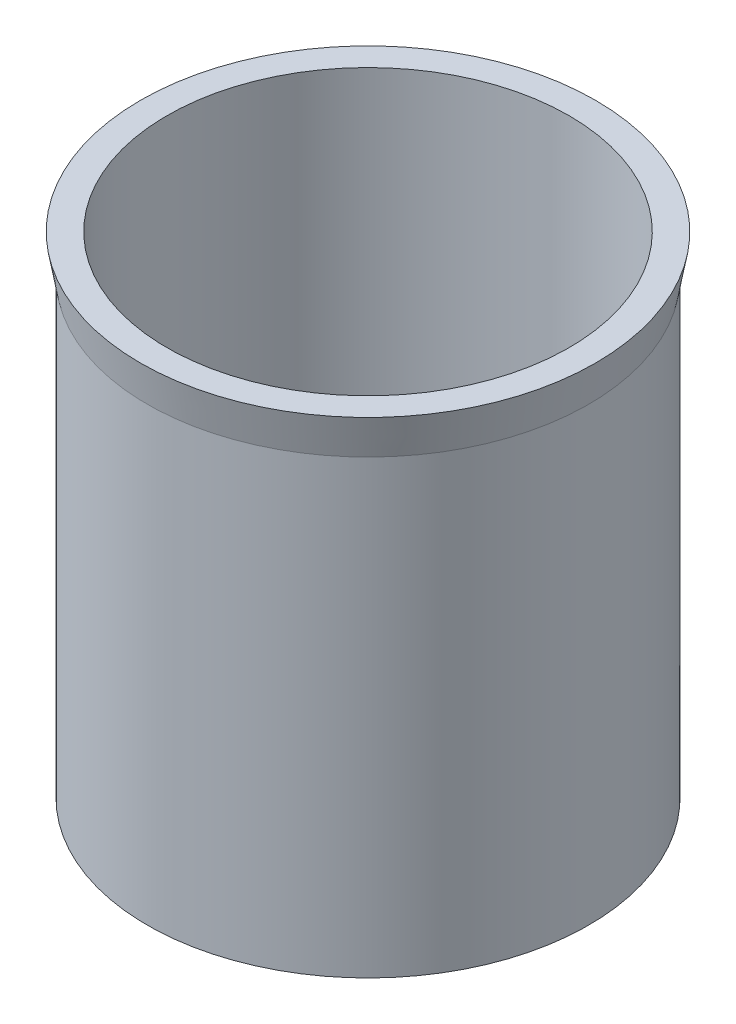
ISO-10303-21;
HEADER;
FILE_DESCRIPTION(('STEP AP214'),'2;1');
FILE_NAME('part.step','',(''),(''),'','','');
FILE_SCHEMA(('AUTOMOTIVE_DESIGN { 1 0 10303 214 1 1 1 1 }'));
ENDSEC;
DATA;
#1=APPLICATION_CONTEXT('core data for automotive mechanical design processes');
#2=APPLICATION_PROTOCOL_DEFINITION('international standard','automotive_design',2000,#1);
#3=PRODUCT_CONTEXT('',#1,'mechanical');
#4=PRODUCT('Part','Part','',(#3));
#5=PRODUCT_RELATED_PRODUCT_CATEGORY('part','',(#4));
#6=PRODUCT_DEFINITION_FORMATION('','',#4);
#7=PRODUCT_DEFINITION_CONTEXT('part definition',#1,'design');
#8=PRODUCT_DEFINITION('design','',#6,#7);
#9=PRODUCT_DEFINITION_SHAPE('','',#8);
#10=(LENGTH_UNIT() NAMED_UNIT(*) SI_UNIT(.MILLI.,.METRE.));
#11=(NAMED_UNIT(*) PLANE_ANGLE_UNIT() SI_UNIT($,.RADIAN.));
#12=(NAMED_UNIT(*) SI_UNIT($,.STERADIAN.) SOLID_ANGLE_UNIT());
#13=UNCERTAINTY_MEASURE_WITH_UNIT(LENGTH_MEASURE(1.E-05),#10,'distance_accuracy_value','');
#14=(GEOMETRIC_REPRESENTATION_CONTEXT(3) GLOBAL_UNCERTAINTY_ASSIGNED_CONTEXT((#13)) GLOBAL_UNIT_ASSIGNED_CONTEXT((#10,
#11,#12)) REPRESENTATION_CONTEXT('',''));
#15=CARTESIAN_POINT('',(0.,0.,0.));
#16=DIRECTION('',(0.,0.,1.));
#17=DIRECTION('',(1.,0.,0.));
#18=AXIS2_PLACEMENT_3D('',#15,#16,#17);
#19=CARTESIAN_POINT('',(0.,0.,0.));
#20=DIRECTION('',(0.,-1.,0.));
#21=DIRECTION('',(0.,0.,-1.));
#22=AXIS2_PLACEMENT_3D('',#19,#20,#21);
#23=CYLINDRICAL_SURFACE('',#22,41.);
#24=CARTESIAN_POINT('',(0.,-85.,0.));
#25=DIRECTION('',(0.,-1.,0.));
#26=DIRECTION('',(0.,0.,-1.));
#27=AXIS2_PLACEMENT_3D('',#24,#25,#26);
#28=CIRCLE('',#27,41.);
#29=CARTESIAN_POINT('',(0.,-85.,-41.));
#30=VERTEX_POINT('',#29);
#31=EDGE_CURVE('E59',#30,#30,#28,.T.);
#32=ORIENTED_EDGE('',*,*,#31,.T.);
#33=EDGE_LOOP('',(#32));
#34=FACE_BOUND('',#33,.T.);
#35=CARTESIAN_POINT('',(0.,0.,0.));
#36=DIRECTION('',(0.,-1.,0.));
#37=DIRECTION('',(0.,0.,-1.));
#38=AXIS2_PLACEMENT_3D('',#35,#36,#37);
#39=CIRCLE('',#38,41.);
#40=CARTESIAN_POINT('',(0.,0.,-41.));
#41=VERTEX_POINT('',#40);
#42=EDGE_CURVE('E10',#41,#41,#39,.T.);
#43=ORIENTED_EDGE('',*,*,#42,.F.);
#44=EDGE_LOOP('',(#43));
#45=FACE_BOUND('',#44,.T.);
#46=ADVANCED_FACE('F35',(#34,#45),#23,.F.);
#47=CARTESIAN_POINT('',(46.4106158456677,0.,0.));
#48=DIRECTION('',(0.,1.,0.));
#49=DIRECTION('',(0.,0.,1.));
#50=AXIS2_PLACEMENT_3D('',#47,#48,#49);
#51=PLANE('',#50);
#52=ORIENTED_EDGE('',*,*,#42,.T.);
#53=EDGE_LOOP('',(#52));
#54=FACE_BOUND('',#53,.T.);
#55=CARTESIAN_POINT('',(0.,0.,0.));
#56=DIRECTION('',(0.,-1.,0.));
#57=DIRECTION('',(0.,0.,-1.));
#58=AXIS2_PLACEMENT_3D('',#55,#56,#57);
#59=CIRCLE('',#58,46.4106158456677);
#60=CARTESIAN_POINT('',(0.,0.,-46.4106158456677));
#61=VERTEX_POINT('',#60);
#62=EDGE_CURVE('E41',#61,#61,#59,.T.);
#63=ORIENTED_EDGE('',*,*,#62,.F.);
#64=EDGE_LOOP('',(#63));
#65=FACE_BOUND('',#64,.T.);
#66=ADVANCED_FACE('F78',(#54,#65),#51,.T.);
#67=CARTESIAN_POINT('',(0.,-8.,0.));
#68=DIRECTION('',(0.,1.,0.));
#69=DIRECTION('',(0.,0.,1.));
#70=AXIS2_PLACEMENT_3D('',#67,#68,#69);
#71=CONICAL_SURFACE('',#70,45.,0.174532925199433);
#72=ORIENTED_EDGE('',*,*,#62,.T.);
#73=EDGE_LOOP('',(#72));
#74=FACE_BOUND('',#73,.T.);
#75=CARTESIAN_POINT('',(0.,-8.,0.));
#76=DIRECTION('',(0.,-1.,0.));
#77=DIRECTION('',(0.,0.,-1.));
#78=AXIS2_PLACEMENT_3D('',#75,#76,#77);
#79=CIRCLE('',#78,45.);
#80=CARTESIAN_POINT('',(0.,-8.,-45.));
#81=VERTEX_POINT('',#80);
#82=EDGE_CURVE('E45',#81,#81,#79,.T.);
#83=ORIENTED_EDGE('',*,*,#82,.F.);
#84=EDGE_LOOP('',(#83));
#85=FACE_BOUND('',#84,.T.);
#86=ADVANCED_FACE('F82',(#74,#85),#71,.T.);
#87=CARTESIAN_POINT('',(0.,0.,0.));
#88=DIRECTION('',(0.,-1.,0.));
#89=DIRECTION('',(0.,0.,-1.));
#90=AXIS2_PLACEMENT_3D('',#87,#88,#89);
#91=CYLINDRICAL_SURFACE('',#90,45.);
#92=ORIENTED_EDGE('',*,*,#82,.T.);
#93=EDGE_LOOP('',(#92));
#94=FACE_BOUND('',#93,.T.);
#95=CARTESIAN_POINT('',(0.,-100.,0.));
#96=DIRECTION('',(0.,-1.,0.));
#97=DIRECTION('',(0.,0.,-1.));
#98=AXIS2_PLACEMENT_3D('',#95,#96,#97);
#99=CIRCLE('',#98,45.);
#100=CARTESIAN_POINT('',(0.,-100.,-45.));
#101=VERTEX_POINT('',#100);
#102=EDGE_CURVE('E49',#101,#101,#99,.T.);
#103=ORIENTED_EDGE('',*,*,#102,.F.);
#104=EDGE_LOOP('',(#103));
#105=FACE_BOUND('',#104,.T.);
#106=ADVANCED_FACE('F74',(#94,#105),#91,.T.);
#107=CARTESIAN_POINT('',(45.,-100.,0.));
#108=DIRECTION('',(0.,-1.,0.));
#109=DIRECTION('',(0.,0.,-1.));
#110=AXIS2_PLACEMENT_3D('',#107,#108,#109);
#111=PLANE('',#110);
#112=ORIENTED_EDGE('',*,*,#102,.T.);
#113=EDGE_LOOP('',(#112));
#114=FACE_BOUND('',#113,.T.);
#115=CARTESIAN_POINT('',(0.,-100.,0.));
#116=DIRECTION('',(0.,-1.,0.));
#117=DIRECTION('',(0.,0.,-1.));
#118=AXIS2_PLACEMENT_3D('',#115,#116,#117);
#119=CIRCLE('',#118,43.6449047106269);
#120=CARTESIAN_POINT('',(0.,-100.,-43.6449047106269));
#121=VERTEX_POINT('',#120);
#122=EDGE_CURVE('E55',#121,#121,#119,.T.);
#123=ORIENTED_EDGE('',*,*,#122,.F.);
#124=EDGE_LOOP('',(#123));
#125=FACE_BOUND('',#124,.T.);
#126=ADVANCED_FACE('F68',(#114,#125),#111,.T.);
#127=CARTESIAN_POINT('',(0.,-85.,0.));
#128=DIRECTION('',(0.,-1.,0.));
#129=DIRECTION('',(0.,0.,-1.));
#130=AXIS2_PLACEMENT_3D('',#127,#128,#129);
#131=CONICAL_SURFACE('',#130,41.,0.174532925199426);
#132=ORIENTED_EDGE('',*,*,#122,.T.);
#133=EDGE_LOOP('',(#132));
#134=FACE_BOUND('',#133,.T.);
#135=ORIENTED_EDGE('',*,*,#31,.F.);
#136=EDGE_LOOP('',(#135));
#137=FACE_BOUND('',#136,.T.);
#138=ADVANCED_FACE('F66',(#134,#137),#131,.F.);
#139=CLOSED_SHELL('',(#46,#66,#86,#106,#126,#138));
#140=MANIFOLD_SOLID_BREP('B2',#139);
#141=ADVANCED_BREP_SHAPE_REPRESENTATION('',(#18,#140),#14);
#142=SHAPE_DEFINITION_REPRESENTATION(#9,#141);
ENDSEC;
END-ISO-10303-21;
